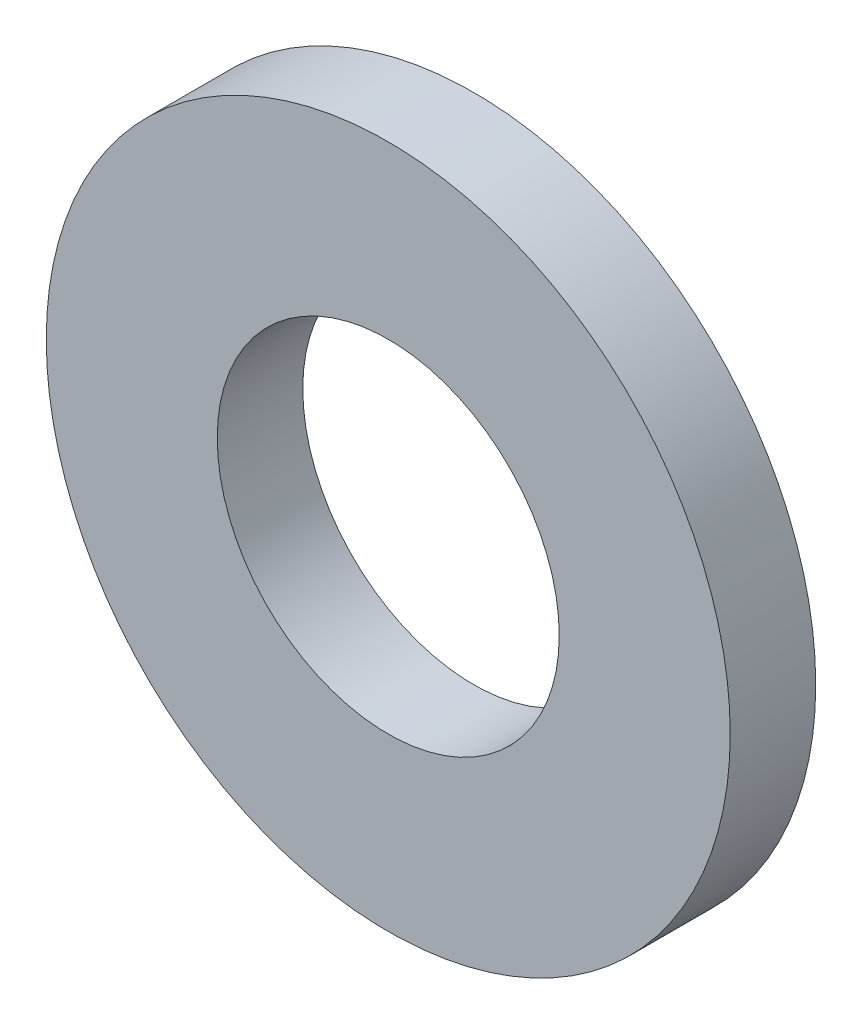
ISO-10303-21;
HEADER;
FILE_DESCRIPTION(('STEP AP214'),'2;1');
FILE_NAME('part.step','',(''),(''),'','','');
FILE_SCHEMA(('AUTOMOTIVE_DESIGN { 1 0 10303 214 1 1 1 1 }'));
ENDSEC;
DATA;
#1=APPLICATION_CONTEXT('core data for automotive mechanical design processes');
#2=APPLICATION_PROTOCOL_DEFINITION('international standard','automotive_design',2000,#1);
#3=PRODUCT_CONTEXT('',#1,'mechanical');
#4=PRODUCT('Part','Part','',(#3));
#5=PRODUCT_RELATED_PRODUCT_CATEGORY('part','',(#4));
#6=PRODUCT_DEFINITION_FORMATION('','',#4);
#7=PRODUCT_DEFINITION_CONTEXT('part definition',#1,'design');
#8=PRODUCT_DEFINITION('design','',#6,#7);
#9=PRODUCT_DEFINITION_SHAPE('','',#8);
#10=(LENGTH_UNIT() NAMED_UNIT(*) SI_UNIT(.MILLI.,.METRE.));
#11=(NAMED_UNIT(*) PLANE_ANGLE_UNIT() SI_UNIT($,.RADIAN.));
#12=(NAMED_UNIT(*) SI_UNIT($,.STERADIAN.) SOLID_ANGLE_UNIT());
#13=UNCERTAINTY_MEASURE_WITH_UNIT(LENGTH_MEASURE(1.E-05),#10,'distance_accuracy_value','');
#14=(GEOMETRIC_REPRESENTATION_CONTEXT(3) GLOBAL_UNCERTAINTY_ASSIGNED_CONTEXT((#13)) GLOBAL_UNIT_ASSIGNED_CONTEXT((#10,
#11,#12)) REPRESENTATION_CONTEXT('',''));
#15=CARTESIAN_POINT('',(0.,0.,0.));
#16=DIRECTION('',(0.,0.,1.));
#17=DIRECTION('',(1.,0.,0.));
#18=AXIS2_PLACEMENT_3D('',#15,#16,#17);
#19=CARTESIAN_POINT('',(0.,0.,2.));
#20=DIRECTION('',(0.,0.,1.));
#21=DIRECTION('',(1.,0.,0.));
#22=AXIS2_PLACEMENT_3D('',#19,#20,#21);
#23=PLANE('',#22);
#24=CARTESIAN_POINT('',(0.,0.,2.));
#25=DIRECTION('',(0.,0.,1.));
#26=DIRECTION('',(1.,0.,0.));
#27=AXIS2_PLACEMENT_3D('',#24,#25,#26);
#28=CIRCLE('',#27,8.);
#29=CARTESIAN_POINT('',(8.,0.,2.));
#30=VERTEX_POINT('',#29);
#31=EDGE_CURVE('E10',#30,#30,#28,.T.);
#32=ORIENTED_EDGE('',*,*,#31,.T.);
#33=EDGE_LOOP('',(#32));
#34=FACE_BOUND('',#33,.T.);
#35=CARTESIAN_POINT('',(0.,0.,2.));
#36=DIRECTION('',(0.,0.,1.));
#37=DIRECTION('',(1.,0.,0.));
#38=AXIS2_PLACEMENT_3D('',#35,#36,#37);
#39=CIRCLE('',#38,4.);
#40=CARTESIAN_POINT('',(4.,0.,2.));
#41=VERTEX_POINT('',#40);
#42=EDGE_CURVE('E41',#41,#41,#39,.T.);
#43=ORIENTED_EDGE('',*,*,#42,.F.);
#44=EDGE_LOOP('',(#43));
#45=FACE_BOUND('',#44,.T.);
#46=ADVANCED_FACE('F30',(#34,#45),#23,.T.);
#47=CARTESIAN_POINT('',(0.,0.,0.));
#48=DIRECTION('',(0.,0.,1.));
#49=DIRECTION('',(1.,0.,0.));
#50=AXIS2_PLACEMENT_3D('',#47,#48,#49);
#51=PLANE('',#50);
#52=CARTESIAN_POINT('',(0.,0.,0.));
#53=DIRECTION('',(0.,0.,1.));
#54=DIRECTION('',(1.,0.,0.));
#55=AXIS2_PLACEMENT_3D('',#52,#53,#54);
#56=CIRCLE('',#55,8.);
#57=CARTESIAN_POINT('',(8.,0.,0.));
#58=VERTEX_POINT('',#57);
#59=EDGE_CURVE('E34',#58,#58,#56,.T.);
#60=ORIENTED_EDGE('',*,*,#59,.F.);
#61=EDGE_LOOP('',(#60));
#62=FACE_BOUND('',#61,.T.);
#63=CARTESIAN_POINT('',(0.,0.,0.));
#64=DIRECTION('',(0.,0.,1.));
#65=DIRECTION('',(1.,0.,0.));
#66=AXIS2_PLACEMENT_3D('',#63,#64,#65);
#67=CIRCLE('',#66,4.);
#68=CARTESIAN_POINT('',(4.,0.,0.));
#69=VERTEX_POINT('',#68);
#70=EDGE_CURVE('E43',#69,#69,#67,.T.);
#71=ORIENTED_EDGE('',*,*,#70,.T.);
#72=EDGE_LOOP('',(#71));
#73=FACE_BOUND('',#72,.T.);
#74=ADVANCED_FACE('F53',(#62,#73),#51,.F.);
#75=CARTESIAN_POINT('',(0.,0.,2.));
#76=DIRECTION('',(0.,0.,-1.));
#77=DIRECTION('',(-1.,0.,0.));
#78=AXIS2_PLACEMENT_3D('',#75,#76,#77);
#79=CYLINDRICAL_SURFACE('',#78,8.);
#80=ORIENTED_EDGE('',*,*,#31,.F.);
#81=EDGE_LOOP('',(#80));
#82=FACE_BOUND('',#81,.T.);
#83=ORIENTED_EDGE('',*,*,#59,.T.);
#84=EDGE_LOOP('',(#83));
#85=FACE_BOUND('',#84,.T.);
#86=ADVANCED_FACE('F32',(#82,#85),#79,.T.);
#87=CARTESIAN_POINT('',(0.,0.,2.));
#88=DIRECTION('',(0.,0.,-1.));
#89=DIRECTION('',(-1.,0.,0.));
#90=AXIS2_PLACEMENT_3D('',#87,#88,#89);
#91=CYLINDRICAL_SURFACE('',#90,4.);
#92=ORIENTED_EDGE('',*,*,#42,.T.);
#93=EDGE_LOOP('',(#92));
#94=FACE_BOUND('',#93,.T.);
#95=ORIENTED_EDGE('',*,*,#70,.F.);
#96=EDGE_LOOP('',(#95));
#97=FACE_BOUND('',#96,.T.);
#98=ADVANCED_FACE('F49',(#94,#97),#91,.F.);
#99=CLOSED_SHELL('',(#46,#74,#86,#98));
#100=MANIFOLD_SOLID_BREP('B2',#99);
#101=ADVANCED_BREP_SHAPE_REPRESENTATION('',(#18,#100),#14);
#102=SHAPE_DEFINITION_REPRESENTATION(#9,#101);
ENDSEC;
END-ISO-10303-21;
